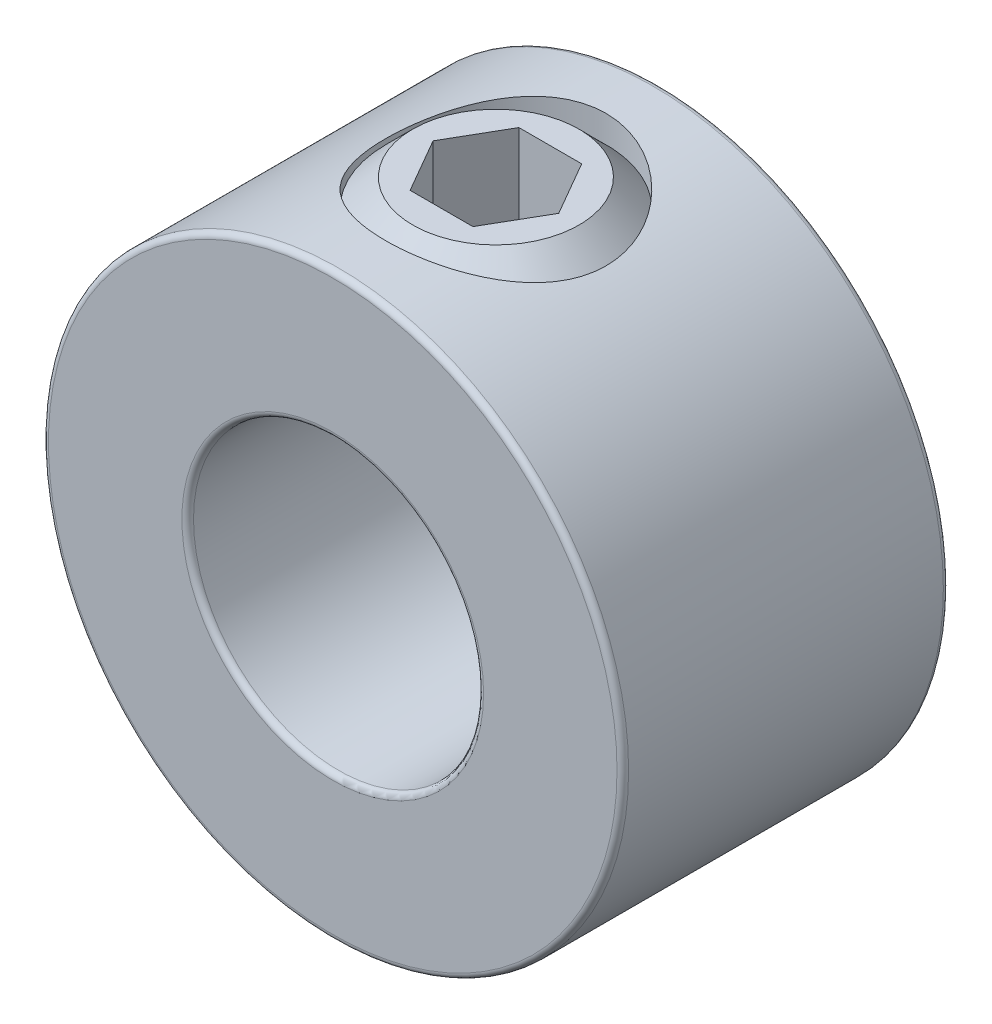
ISO-10303-21;
HEADER;
FILE_DESCRIPTION(('STEP AP214'),'2;1');
FILE_NAME('part.step','',(''),(''),'','','');
FILE_SCHEMA(('AUTOMOTIVE_DESIGN { 1 0 10303 214 1 1 1 1 }'));
ENDSEC;
DATA;
#1=APPLICATION_CONTEXT('core data for automotive mechanical design processes');
#2=APPLICATION_PROTOCOL_DEFINITION('international standard','automotive_design',2000,#1);
#3=PRODUCT_CONTEXT('',#1,'mechanical');
#4=PRODUCT('Part','Part','',(#3));
#5=PRODUCT_RELATED_PRODUCT_CATEGORY('part','',(#4));
#6=PRODUCT_DEFINITION_FORMATION('','',#4);
#7=PRODUCT_DEFINITION_CONTEXT('part definition',#1,'design');
#8=PRODUCT_DEFINITION('design','',#6,#7);
#9=PRODUCT_DEFINITION_SHAPE('','',#8);
#10=(LENGTH_UNIT() NAMED_UNIT(*) SI_UNIT(.MILLI.,.METRE.));
#11=(NAMED_UNIT(*) PLANE_ANGLE_UNIT() SI_UNIT($,.RADIAN.));
#12=(NAMED_UNIT(*) SI_UNIT($,.STERADIAN.) SOLID_ANGLE_UNIT());
#13=UNCERTAINTY_MEASURE_WITH_UNIT(LENGTH_MEASURE(1.E-05),#10,'distance_accuracy_value','');
#14=(GEOMETRIC_REPRESENTATION_CONTEXT(3) GLOBAL_UNCERTAINTY_ASSIGNED_CONTEXT((#13)) GLOBAL_UNIT_ASSIGNED_CONTEXT((#10,
#11,#12)) REPRESENTATION_CONTEXT('',''));
#15=CARTESIAN_POINT('',(0.,0.,0.));
#16=DIRECTION('',(0.,0.,1.));
#17=DIRECTION('',(1.,0.,0.));
#18=AXIS2_PLACEMENT_3D('',#15,#16,#17);
#19=CARTESIAN_POINT('',(0.,6.35,0.));
#20=DIRECTION('',(0.,1.,0.));
#21=DIRECTION('',(-1.,0.,0.));
#22=AXIS2_PLACEMENT_3D('',#19,#20,#21);
#23=PLANE('',#22);
#24=CARTESIAN_POINT('',(0.,6.35,0.));
#25=DIRECTION('',(0.,1.,0.));
#26=DIRECTION('',(-1.,0.,0.));
#27=AXIS2_PLACEMENT_3D('',#24,#25,#26);
#28=CIRCLE('',#27,1.81975161629017);
#29=CARTESIAN_POINT('',(-1.81975161629017,6.35,0.));
#30=VERTEX_POINT('',#29);
#31=EDGE_CURVE('E12',#30,#30,#28,.T.);
#32=ORIENTED_EDGE('',*,*,#31,.T.);
#33=EDGE_LOOP('',(#32));
#34=FACE_BOUND('',#33,.T.);
#35=DIRECTION('',(1.,0.,0.));
#36=VECTOR('',#35,1.);
#37=CARTESIAN_POINT('',(-0.687407664253899,6.34999999999999,-1.190625));
#38=LINE('',#37,#36);
#39=CARTESIAN_POINT('',(-0.687407664253899,6.34999999999999,-1.190625));
#40=VERTEX_POINT('',#39);
#41=CARTESIAN_POINT('',(0.687407664253899,6.35,-1.190625));
#42=VERTEX_POINT('',#41);
#43=EDGE_CURVE('E110',#40,#42,#38,.T.);
#44=ORIENTED_EDGE('',*,*,#43,.T.);
#45=DIRECTION('',(0.5,0.,0.866025403784439));
#46=VECTOR('',#45,1.);
#47=CARTESIAN_POINT('',(0.687407664253899,6.34999999999999,-1.190625));
#48=LINE('',#47,#46);
#49=CARTESIAN_POINT('',(1.3748153285078,6.34999999999999,0.));
#50=VERTEX_POINT('',#49);
#51=EDGE_CURVE('E56',#42,#50,#48,.T.);
#52=ORIENTED_EDGE('',*,*,#51,.T.);
#53=DIRECTION('',(-0.5,0.,0.866025403784439));
#54=VECTOR('',#53,1.);
#55=CARTESIAN_POINT('',(1.3748153285078,6.34999999999999,0.));
#56=LINE('',#55,#54);
#57=CARTESIAN_POINT('',(0.687407664253899,6.34999999999999,1.190625));
#58=VERTEX_POINT('',#57);
#59=EDGE_CURVE('E114',#50,#58,#56,.T.);
#60=ORIENTED_EDGE('',*,*,#59,.T.);
#61=DIRECTION('',(-1.,0.,0.));
#62=VECTOR('',#61,1.);
#63=CARTESIAN_POINT('',(0.687407664253899,6.34999999999999,1.190625));
#64=LINE('',#63,#62);
#65=CARTESIAN_POINT('',(-0.687407664253898,6.34999999999999,1.190625));
#66=VERTEX_POINT('',#65);
#67=EDGE_CURVE('E177',#58,#66,#64,.T.);
#68=ORIENTED_EDGE('',*,*,#67,.T.);
#69=DIRECTION('',(-0.5,0.,-0.866025403784439));
#70=VECTOR('',#69,1.);
#71=CARTESIAN_POINT('',(-0.687407664253898,6.34999999999999,1.190625));
#72=LINE('',#71,#70);
#73=CARTESIAN_POINT('',(-1.3748153285078,6.34999999999999,0.));
#74=VERTEX_POINT('',#73);
#75=EDGE_CURVE('E162',#66,#74,#72,.T.);
#76=ORIENTED_EDGE('',*,*,#75,.T.);
#77=DIRECTION('',(0.5,0.,-0.866025403784439));
#78=VECTOR('',#77,1.);
#79=CARTESIAN_POINT('',(-1.3748153285078,6.34999999999999,0.));
#80=LINE('',#79,#78);
#81=EDGE_CURVE('E158',#74,#40,#80,.T.);
#82=ORIENTED_EDGE('',*,*,#81,.T.);
#83=EDGE_LOOP('',(#44,#52,#60,#68,#76,#82));
#84=FACE_BOUND('',#83,.T.);
#85=ADVANCED_FACE('F42',(#34,#84),#23,.T.);
#86=CARTESIAN_POINT('',(0.,6.35,0.));
#87=DIRECTION('',(0.,-1.,0.));
#88=DIRECTION('',(1.,0.,0.));
#89=AXIS2_PLACEMENT_3D('',#86,#87,#88);
#90=CONICAL_SURFACE('',#89,1.81975161629017,0.785398163397448);
#91=CARTESIAN_POINT('',(0.,5.75675161629017,0.));
#92=DIRECTION('',(0.,1.,0.));
#93=DIRECTION('',(-1.,0.,0.));
#94=AXIS2_PLACEMENT_3D('',#91,#92,#93);
#95=CIRCLE('',#94,2.413);
#96=CARTESIAN_POINT('',(-2.413,5.75675161629017,0.));
#97=VERTEX_POINT('',#96);
#98=EDGE_CURVE('E49',#97,#97,#95,.T.);
#99=ORIENTED_EDGE('',*,*,#98,.T.);
#100=EDGE_LOOP('',(#99));
#101=FACE_BOUND('',#100,.T.);
#102=ORIENTED_EDGE('',*,*,#31,.F.);
#103=EDGE_LOOP('',(#102));
#104=FACE_BOUND('',#103,.T.);
#105=ADVANCED_FACE('F132',(#101,#104),#90,.T.);
#106=CARTESIAN_POINT('',(0.,3.175,0.));
#107=DIRECTION('',(0.,1.,0.));
#108=DIRECTION('',(-1.,0.,0.));
#109=AXIS2_PLACEMENT_3D('',#106,#107,#108);
#110=CYLINDRICAL_SURFACE('',#109,2.413);
#111=CARTESIAN_POINT('',(0.,3.76824838370983,0.));
#112=DIRECTION('',(0.,1.,0.));
#113=DIRECTION('',(-1.,0.,0.));
#114=AXIS2_PLACEMENT_3D('',#111,#112,#113);
#115=CIRCLE('',#114,2.413);
#116=CARTESIAN_POINT('',(-2.413,3.76824838370983,0.));
#117=VERTEX_POINT('',#116);
#118=EDGE_CURVE('E127',#117,#117,#115,.T.);
#119=ORIENTED_EDGE('',*,*,#118,.T.);
#120=EDGE_LOOP('',(#119));
#121=FACE_BOUND('',#120,.T.);
#122=ORIENTED_EDGE('',*,*,#98,.F.);
#123=EDGE_LOOP('',(#122));
#124=FACE_BOUND('',#123,.T.);
#125=ADVANCED_FACE('F135',(#121,#124),#110,.T.);
#126=CARTESIAN_POINT('',(0.,3.76824838370983,0.));
#127=DIRECTION('',(0.,1.,0.));
#128=DIRECTION('',(-1.,0.,0.));
#129=AXIS2_PLACEMENT_3D('',#126,#127,#128);
#130=CONICAL_SURFACE('',#129,2.413,0.785398163397448);
#131=CARTESIAN_POINT('',(0.,3.175,0.));
#132=DIRECTION('',(0.,1.,0.));
#133=DIRECTION('',(-1.,0.,0.));
#134=AXIS2_PLACEMENT_3D('',#131,#132,#133);
#135=CIRCLE('',#134,1.81975161629017);
#136=CARTESIAN_POINT('',(-1.81975161629017,3.175,0.));
#137=VERTEX_POINT('',#136);
#138=EDGE_CURVE('E119',#137,#137,#135,.T.);
#139=ORIENTED_EDGE('',*,*,#138,.T.);
#140=EDGE_LOOP('',(#139));
#141=FACE_BOUND('',#140,.T.);
#142=ORIENTED_EDGE('',*,*,#118,.F.);
#143=EDGE_LOOP('',(#142));
#144=FACE_BOUND('',#143,.T.);
#145=ADVANCED_FACE('F137',(#141,#144),#130,.T.);
#146=CARTESIAN_POINT('',(-1.81975161629017,3.175,0.));
#147=DIRECTION('',(0.,-1.,0.));
#148=DIRECTION('',(1.,0.,0.));
#149=AXIS2_PLACEMENT_3D('',#146,#147,#148);
#150=PLANE('',#149);
#151=CARTESIAN_POINT('',(0.,3.175,0.));
#152=DIRECTION('',(0.,1.,0.));
#153=DIRECTION('',(-1.,0.,0.));
#154=AXIS2_PLACEMENT_3D('',#151,#152,#153);
#155=CIRCLE('',#154,0.711898060451796);
#156=CARTESIAN_POINT('',(-0.711898060451796,3.175,0.));
#157=VERTEX_POINT('',#156);
#158=EDGE_CURVE('E115',#157,#157,#155,.T.);
#159=ORIENTED_EDGE('',*,*,#158,.T.);
#160=EDGE_LOOP('',(#159));
#161=FACE_BOUND('',#160,.T.);
#162=ORIENTED_EDGE('',*,*,#138,.F.);
#163=EDGE_LOOP('',(#162));
#164=FACE_BOUND('',#163,.T.);
#165=ADVANCED_FACE('F144',(#161,#164),#150,.T.);
#166=CARTESIAN_POINT('',(0.,3.175,0.));
#167=DIRECTION('',(0.,-1.,0.));
#168=DIRECTION('',(1.,0.,0.));
#169=AXIS2_PLACEMENT_3D('',#166,#167,#168);
#170=CONICAL_SURFACE('',#169,0.711898060451796,0.785398163397448);
#171=CARTESIAN_POINT('',(0.,3.8868980604518,0.));
#172=VERTEX_POINT('',#171);
#173=VERTEX_LOOP('',#172);
#174=FACE_BOUND('',#173,.T.);
#175=ORIENTED_EDGE('',*,*,#158,.F.);
#176=EDGE_LOOP('',(#175));
#177=FACE_BOUND('',#176,.T.);
#178=ADVANCED_FACE('F211',(#174,#177),#170,.F.);
#179=CARTESIAN_POINT('',(0.687407664253899,3.96874999999999,-1.190625));
#180=DIRECTION('',(-0.866025403784439,0.,0.5));
#181=DIRECTION('',(0.5,0.,0.866025403784439));
#182=AXIS2_PLACEMENT_3D('',#179,#180,#181);
#183=PLANE('',#182);
#184=ORIENTED_EDGE('',*,*,#51,.F.);
#185=DIRECTION('',(0.,1.,0.));
#186=VECTOR('',#185,1.);
#187=CARTESIAN_POINT('',(0.687407664253899,3.96874999999999,-1.190625));
#188=LINE('',#187,#186);
#189=CARTESIAN_POINT('',(0.687407664253899,3.96874999999999,-1.190625));
#190=VERTEX_POINT('',#189);
#191=EDGE_CURVE('E109',#190,#42,#188,.T.);
#192=ORIENTED_EDGE('',*,*,#191,.F.);
#193=DIRECTION('',(0.5,0.,0.866025403784439));
#194=VECTOR('',#193,1.);
#195=CARTESIAN_POINT('',(0.687407664253899,3.96874999999999,-1.190625));
#196=LINE('',#195,#194);
#197=CARTESIAN_POINT('',(1.3748153285078,3.96874999999999,0.));
#198=VERTEX_POINT('',#197);
#199=EDGE_CURVE('E100',#190,#198,#196,.T.);
#200=ORIENTED_EDGE('',*,*,#199,.T.);
#201=DIRECTION('',(0.,1.,0.));
#202=VECTOR('',#201,1.);
#203=CARTESIAN_POINT('',(1.3748153285078,3.96874999999999,0.));
#204=LINE('',#203,#202);
#205=EDGE_CURVE('E108',#198,#50,#204,.T.);
#206=ORIENTED_EDGE('',*,*,#205,.T.);
#207=EDGE_LOOP('',(#184,#192,#200,#206));
#208=FACE_BOUND('',#207,.T.);
#209=ADVANCED_FACE('F107',(#208),#183,.T.);
#210=CARTESIAN_POINT('',(1.3748153285078,3.96874999999999,0.));
#211=DIRECTION('',(-0.866025403784439,0.,-0.5));
#212=DIRECTION('',(-0.5,0.,0.866025403784439));
#213=AXIS2_PLACEMENT_3D('',#210,#211,#212);
#214=PLANE('',#213);
#215=ORIENTED_EDGE('',*,*,#59,.F.);
#216=ORIENTED_EDGE('',*,*,#205,.F.);
#217=DIRECTION('',(-0.5,0.,0.866025403784439));
#218=VECTOR('',#217,1.);
#219=CARTESIAN_POINT('',(1.3748153285078,3.96874999999999,0.));
#220=LINE('',#219,#218);
#221=CARTESIAN_POINT('',(0.687407664253899,3.96874999999999,1.190625));
#222=VERTEX_POINT('',#221);
#223=EDGE_CURVE('E96',#198,#222,#220,.T.);
#224=ORIENTED_EDGE('',*,*,#223,.T.);
#225=DIRECTION('',(0.,1.,0.));
#226=VECTOR('',#225,1.);
#227=CARTESIAN_POINT('',(0.687407664253899,3.96874999999999,1.190625));
#228=LINE('',#227,#226);
#229=EDGE_CURVE('E116',#222,#58,#228,.T.);
#230=ORIENTED_EDGE('',*,*,#229,.T.);
#231=EDGE_LOOP('',(#215,#216,#224,#230));
#232=FACE_BOUND('',#231,.T.);
#233=ADVANCED_FACE('F112',(#232),#214,.T.);
#234=CARTESIAN_POINT('',(0.687407664253899,3.96874999999999,1.190625));
#235=DIRECTION('',(0.,0.,-1.));
#236=DIRECTION('',(-1.,0.,0.));
#237=AXIS2_PLACEMENT_3D('',#234,#235,#236);
#238=PLANE('',#237);
#239=ORIENTED_EDGE('',*,*,#67,.F.);
#240=ORIENTED_EDGE('',*,*,#229,.F.);
#241=DIRECTION('',(-1.,0.,0.));
#242=VECTOR('',#241,1.);
#243=CARTESIAN_POINT('',(0.687407664253899,3.96874999999999,1.190625));
#244=LINE('',#243,#242);
#245=CARTESIAN_POINT('',(-0.687407664253898,3.96874999999999,1.190625));
#246=VERTEX_POINT('',#245);
#247=EDGE_CURVE('E102',#222,#246,#244,.T.);
#248=ORIENTED_EDGE('',*,*,#247,.T.);
#249=DIRECTION('',(0.,1.,0.));
#250=VECTOR('',#249,1.);
#251=CARTESIAN_POINT('',(-0.687407664253898,3.96874999999999,1.190625));
#252=LINE('',#251,#250);
#253=EDGE_CURVE('E121',#246,#66,#252,.T.);
#254=ORIENTED_EDGE('',*,*,#253,.T.);
#255=EDGE_LOOP('',(#239,#240,#248,#254));
#256=FACE_BOUND('',#255,.T.);
#257=ADVANCED_FACE('F175',(#256),#238,.T.);
#258=CARTESIAN_POINT('',(-0.687407664253898,3.96874999999999,1.190625));
#259=DIRECTION('',(0.866025403784439,0.,-0.5));
#260=DIRECTION('',(-0.5,0.,-0.866025403784438));
#261=AXIS2_PLACEMENT_3D('',#258,#259,#260);
#262=PLANE('',#261);
#263=ORIENTED_EDGE('',*,*,#75,.F.);
#264=ORIENTED_EDGE('',*,*,#253,.F.);
#265=DIRECTION('',(-0.5,0.,-0.866025403784439));
#266=VECTOR('',#265,1.);
#267=CARTESIAN_POINT('',(-0.687407664253898,3.96874999999999,1.190625));
#268=LINE('',#267,#266);
#269=CARTESIAN_POINT('',(-1.3748153285078,3.96874999999999,0.));
#270=VERTEX_POINT('',#269);
#271=EDGE_CURVE('E188',#246,#270,#268,.T.);
#272=ORIENTED_EDGE('',*,*,#271,.T.);
#273=DIRECTION('',(0.,1.,0.));
#274=VECTOR('',#273,1.);
#275=CARTESIAN_POINT('',(-1.3748153285078,3.96874999999999,0.));
#276=LINE('',#275,#274);
#277=EDGE_CURVE('E170',#270,#74,#276,.T.);
#278=ORIENTED_EDGE('',*,*,#277,.T.);
#279=EDGE_LOOP('',(#263,#264,#272,#278));
#280=FACE_BOUND('',#279,.T.);
#281=ADVANCED_FACE('F179',(#280),#262,.T.);
#282=CARTESIAN_POINT('',(-1.3748153285078,3.96874999999999,0.));
#283=DIRECTION('',(0.866025403784439,0.,0.5));
#284=DIRECTION('',(0.5,0.,-0.866025403784439));
#285=AXIS2_PLACEMENT_3D('',#282,#283,#284);
#286=PLANE('',#285);
#287=ORIENTED_EDGE('',*,*,#81,.F.);
#288=ORIENTED_EDGE('',*,*,#277,.F.);
#289=DIRECTION('',(0.5,0.,-0.866025403784439));
#290=VECTOR('',#289,1.);
#291=CARTESIAN_POINT('',(-1.3748153285078,3.96874999999999,0.));
#292=LINE('',#291,#290);
#293=CARTESIAN_POINT('',(-0.687407664253899,3.96874999999999,-1.190625));
#294=VERTEX_POINT('',#293);
#295=EDGE_CURVE('E186',#270,#294,#292,.T.);
#296=ORIENTED_EDGE('',*,*,#295,.T.);
#297=DIRECTION('',(0.,1.,0.));
#298=VECTOR('',#297,1.);
#299=CARTESIAN_POINT('',(-0.687407664253899,3.96874999999999,-1.190625));
#300=LINE('',#299,#298);
#301=EDGE_CURVE('E167',#294,#40,#300,.T.);
#302=ORIENTED_EDGE('',*,*,#301,.T.);
#303=EDGE_LOOP('',(#287,#288,#296,#302));
#304=FACE_BOUND('',#303,.T.);
#305=ADVANCED_FACE('F192',(#304),#286,.T.);
#306=CARTESIAN_POINT('',(-0.687407664253899,3.96874999999999,-1.190625));
#307=DIRECTION('',(0.,0.,1.));
#308=DIRECTION('',(1.,0.,0.));
#309=AXIS2_PLACEMENT_3D('',#306,#307,#308);
#310=PLANE('',#309);
#311=ORIENTED_EDGE('',*,*,#43,.F.);
#312=ORIENTED_EDGE('',*,*,#301,.F.);
#313=DIRECTION('',(1.,0.,0.));
#314=VECTOR('',#313,1.);
#315=CARTESIAN_POINT('',(-0.687407664253899,3.96874999999999,-1.190625));
#316=LINE('',#315,#314);
#317=EDGE_CURVE('E168',#294,#190,#316,.T.);
#318=ORIENTED_EDGE('',*,*,#317,.T.);
#319=ORIENTED_EDGE('',*,*,#191,.T.);
#320=EDGE_LOOP('',(#311,#312,#318,#319));
#321=FACE_BOUND('',#320,.T.);
#322=ADVANCED_FACE('F193',(#321),#310,.T.);
#323=CARTESIAN_POINT('',(2.06222299276169,3.96874999999999,1.190625));
#324=DIRECTION('',(0.,-1.,0.));
#325=DIRECTION('',(0.,0.,-1.));
#326=AXIS2_PLACEMENT_3D('',#323,#324,#325);
#327=PLANE('',#326);
#328=ORIENTED_EDGE('',*,*,#199,.F.);
#329=ORIENTED_EDGE('',*,*,#317,.F.);
#330=ORIENTED_EDGE('',*,*,#295,.F.);
#331=ORIENTED_EDGE('',*,*,#271,.F.);
#332=ORIENTED_EDGE('',*,*,#247,.F.);
#333=ORIENTED_EDGE('',*,*,#223,.F.);
#334=EDGE_LOOP('',(#328,#329,#330,#331,#332,#333));
#335=FACE_BOUND('',#334,.T.);
#336=ADVANCED_FACE('F98',(#335),#327,.F.);
#337=CLOSED_SHELL('',(#85,#105,#125,#145,#165,#178,#209,#233,#257,#281,#305,#322,#336));
#338=MANIFOLD_SOLID_BREP('B2',#337);
#339=CARTESIAN_POINT('',(0.,0.,3.571875));
#340=DIRECTION('',(0.,0.,1.));
#341=DIRECTION('',(1.,0.,0.));
#342=AXIS2_PLACEMENT_3D('',#339,#340,#341);
#343=PLANE('',#342);
#344=CARTESIAN_POINT('',(0.,0.,3.571875));
#345=DIRECTION('',(0.,0.,1.));
#346=DIRECTION('',(1.,0.,0.));
#347=AXIS2_PLACEMENT_3D('',#344,#345,#346);
#348=CIRCLE('',#347,3.302);
#349=CARTESIAN_POINT('',(3.302,0.,3.571875));
#350=VERTEX_POINT('',#349);
#351=EDGE_CURVE('E307',#350,#350,#348,.F.);
#352=ORIENTED_EDGE('',*,*,#351,.T.);
#353=EDGE_LOOP('',(#352));
#354=FACE_BOUND('',#353,.T.);
#355=CARTESIAN_POINT('',(0.,0.,3.571875));
#356=DIRECTION('',(0.,0.,1.));
#357=DIRECTION('',(1.,0.,0.));
#358=AXIS2_PLACEMENT_3D('',#355,#356,#357);
#359=CIRCLE('',#358,6.223);
#360=CARTESIAN_POINT('',(6.223,0.,3.571875));
#361=VERTEX_POINT('',#360);
#362=EDGE_CURVE('E311',#361,#361,#359,.T.);
#363=ORIENTED_EDGE('',*,*,#362,.T.);
#364=EDGE_LOOP('',(#363));
#365=FACE_BOUND('',#364,.T.);
#366=ADVANCED_FACE('F296',(#354,#365),#343,.T.);
#367=CARTESIAN_POINT('',(0.,0.,-3.571875));
#368=DIRECTION('',(0.,0.,1.));
#369=DIRECTION('',(1.,0.,0.));
#370=AXIS2_PLACEMENT_3D('',#367,#368,#369);
#371=PLANE('',#370);
#372=CARTESIAN_POINT('',(0.,0.,-3.571875));
#373=DIRECTION('',(0.,0.,1.));
#374=DIRECTION('',(1.,0.,0.));
#375=AXIS2_PLACEMENT_3D('',#372,#373,#374);
#376=CIRCLE('',#375,3.302);
#377=CARTESIAN_POINT('',(3.302,0.,-3.571875));
#378=VERTEX_POINT('',#377);
#379=EDGE_CURVE('E322',#378,#378,#376,.T.);
#380=ORIENTED_EDGE('',*,*,#379,.T.);
#381=EDGE_LOOP('',(#380));
#382=FACE_BOUND('',#381,.T.);
#383=CARTESIAN_POINT('',(0.,0.,-3.571875));
#384=DIRECTION('',(0.,0.,1.));
#385=DIRECTION('',(1.,0.,0.));
#386=AXIS2_PLACEMENT_3D('',#383,#384,#385);
#387=CIRCLE('',#386,6.223);
#388=CARTESIAN_POINT('',(6.223,0.,-3.571875));
#389=VERTEX_POINT('',#388);
#390=EDGE_CURVE('E325',#389,#389,#387,.F.);
#391=ORIENTED_EDGE('',*,*,#390,.T.);
#392=EDGE_LOOP('',(#391));
#393=FACE_BOUND('',#392,.T.);
#394=ADVANCED_FACE('F361',(#382,#393),#371,.F.);
#395=CARTESIAN_POINT('',(0.,0.,3.571875));
#396=DIRECTION('',(0.,0.,-1.));
#397=DIRECTION('',(-1.,0.,0.));
#398=AXIS2_PLACEMENT_3D('',#395,#396,#397);
#399=CYLINDRICAL_SURFACE('',#398,6.35);
#400=CARTESIAN_POINT('',(0.,0.,-3.444875));
#401=DIRECTION('',(0.,0.,1.));
#402=DIRECTION('',(1.,0.,0.));
#403=AXIS2_PLACEMENT_3D('',#400,#401,#402);
#404=CIRCLE('',#403,6.35);
#405=CARTESIAN_POINT('',(6.35,0.,-3.444875));
#406=VERTEX_POINT('',#405);
#407=EDGE_CURVE('E41',#406,#406,#404,.T.);
#408=ORIENTED_EDGE('',*,*,#407,.T.);
#409=EDGE_LOOP('',(#408));
#410=FACE_BOUND('',#409,.T.);
#411=CARTESIAN_POINT('',(0.,0.,3.444875));
#412=DIRECTION('',(0.,0.,1.));
#413=DIRECTION('',(1.,0.,0.));
#414=AXIS2_PLACEMENT_3D('',#411,#412,#413);
#415=CIRCLE('',#414,6.35);
#416=CARTESIAN_POINT('',(6.35,0.,3.444875));
#417=VERTEX_POINT('',#416);
#418=EDGE_CURVE('E303',#417,#417,#415,.F.);
#419=ORIENTED_EDGE('',*,*,#418,.T.);
#420=EDGE_LOOP('',(#419));
#421=FACE_BOUND('',#420,.T.);
#422=CARTESIAN_POINT('',(0.,6.35,-2.413));
#423=CARTESIAN_POINT('',(0.130555931467962,6.35000398969011,-2.41300527534602));
#424=CARTESIAN_POINT('',(0.261076241377739,6.34593890816647,-2.4023714543113));
#425=CARTESIAN_POINT('',(0.518209446534913,6.33012963929965,-2.36029479676423));
#426=CARTESIAN_POINT('',(0.644823015088655,6.31838678300935,-2.32885556715778));
#427=CARTESIAN_POINT('',(0.890396734122701,6.28848040494,-2.24644511602075));
#428=CARTESIAN_POINT('',(1.00937135935963,6.27032947705095,-2.19551218938446));
#429=CARTESIAN_POINT('',(1.23707694907279,6.22940932060409,-2.07575764561934));
#430=CARTESIAN_POINT('',(1.34580507871092,6.20663881943741,-2.00693109764769));
#431=CARTESIAN_POINT('',(1.5546544090621,6.15771932779737,-1.85022277092613));
#432=CARTESIAN_POINT('',(1.65427192875035,6.13147296383124,-1.76170041624995));
#433=CARTESIAN_POINT('',(1.83765571561736,6.07903240405007,-1.56947315042905));
#434=CARTESIAN_POINT('',(1.92141693988139,6.05283822744466,-1.46576342765122));
#435=CARTESIAN_POINT('',(2.07395660623911,6.00232668170519,-1.24113386470124));
#436=CARTESIAN_POINT('',(2.14201618015845,5.97812365120729,-1.11969756154783));
#437=CARTESIAN_POINT('',(2.25652093858858,5.93585432476053,-0.866038380432351));
#438=CARTESIAN_POINT('',(2.30297502037546,5.91778550353544,-0.733819969020803));
#439=CARTESIAN_POINT('',(2.37094947712185,5.89087364983883,-0.46815363189803));
#440=CARTESIAN_POINT('',(2.39343294050412,5.88167580744491,-0.334989300795486));
#441=CARTESIAN_POINT('',(2.41583880524757,5.87251090464605,-0.0664845962936197));
#442=CARTESIAN_POINT('',(2.41577084821779,5.87253989940926,0.0688548224232351));
#443=CARTESIAN_POINT('',(2.39381090108878,5.88152011871453,0.328972227003014));
#444=CARTESIAN_POINT('',(2.37326609797153,5.88992057372023,0.453886522563246));
#445=CARTESIAN_POINT('',(2.31316652422954,5.91378008823147,0.698339704990829));
#446=CARTESIAN_POINT('',(2.27360881167116,5.92924024008996,0.817877756841903));
#447=CARTESIAN_POINT('',(2.17588364092748,5.96580146890692,1.0508916152852));
#448=CARTESIAN_POINT('',(2.11737290423754,5.98700531598431,1.16420661484106));
#449=CARTESIAN_POINT('',(1.98364217411328,6.03263175509447,1.37979639920587));
#450=CARTESIAN_POINT('',(1.90841630395244,6.05705547794376,1.4820672822727));
#451=CARTESIAN_POINT('',(1.73726689770536,6.10842961274997,1.68010694238863));
#452=CARTESIAN_POINT('',(1.64027173491613,6.13543795015635,1.77493688260015));
#453=CARTESIAN_POINT('',(1.43144868882472,6.18748920351012,1.94726806056401));
#454=CARTESIAN_POINT('',(1.31961840653187,6.2125318005324,2.02476649017818));
#455=CARTESIAN_POINT('',(1.08185265975391,6.25835188225341,2.16130771487283));
#456=CARTESIAN_POINT('',(0.955717417234618,6.27905339803369,2.22002994310971));
#457=CARTESIAN_POINT('',(0.694375189035109,6.31329326294077,2.31510736575226));
#458=CARTESIAN_POINT('',(0.559172376611221,6.32683488218724,2.3514727723643));
#459=CARTESIAN_POINT('',(0.291428150212525,6.3446501972992,2.39898109857718));
#460=CARTESIAN_POINT('',(0.159141645079808,6.34938771868047,2.41138775288999));
#461=CARTESIAN_POINT('',(-0.105693065348276,6.35049981057155,2.41431626348443));
#462=CARTESIAN_POINT('',(-0.238241203822052,6.34687629478166,2.40484312768025));
#463=CARTESIAN_POINT('',(-0.494323602805378,6.33197908606406,2.36523562382545));
#464=CARTESIAN_POINT('',(-0.61800684441211,6.32101461634214,2.33593589818825));
#465=CARTESIAN_POINT('',(-0.858609565436108,6.29285092848222,2.25861304376362));
#466=CARTESIAN_POINT('',(-0.975528163914414,6.27565090041604,2.21058748264173));
#467=CARTESIAN_POINT('',(-1.20317276582384,6.23607457125026,2.09563503714011));
#468=CARTESIAN_POINT('',(-1.3136121499673,6.21355984396609,2.02818967610491));
#469=CARTESIAN_POINT('',(-1.52197988578177,6.16583504517286,1.87689595883598));
#470=CARTESIAN_POINT('',(-1.61990351002366,6.14062396176678,1.79304143465584));
#471=CARTESIAN_POINT('',(-1.80656807112922,6.08841217199752,1.60543272496061));
#472=CARTESIAN_POINT('',(-1.89441393314817,6.06139435477813,1.5007904098217));
#473=CARTESIAN_POINT('',(-2.05148411432654,6.01005496187559,1.27772800811267));
#474=CARTESIAN_POINT('',(-2.12070651399853,5.98573366426972,1.15930650314625));
#475=CARTESIAN_POINT('',(-2.23870023772464,5.94261798623815,0.910922748538602));
#476=CARTESIAN_POINT('',(-2.28736466342468,5.92385264334907,0.780904332023381));
#477=CARTESIAN_POINT('',(-2.36177800946808,5.89458517077402,0.513602694331982));
#478=CARTESIAN_POINT('',(-2.38754162954713,5.8840777409413,0.376324193363579));
#479=CARTESIAN_POINT('',(-2.41408994040532,5.87323215610138,0.108127165215383));
#480=CARTESIAN_POINT('',(-2.41640623148607,5.87227054588007,-0.0226157343841075));
#481=CARTESIAN_POINT('',(-2.3999373204655,5.8790202253426,-0.282524873396556));
#482=CARTESIAN_POINT('',(-2.38115423316032,5.88673064582666,-0.41169126951125));
#483=CARTESIAN_POINT('',(-2.32422421188573,5.90943043237583,-0.660552265849344));
#484=CARTESIAN_POINT('',(-2.28672002796391,5.92417751295514,-0.780417919491674));
#485=CARTESIAN_POINT('',(-2.19398528189399,5.95914188552999,-1.01222145618602));
#486=CARTESIAN_POINT('',(-2.13875018285588,5.97936057736356,-1.12415730124382));
#487=CARTESIAN_POINT('',(-2.00869997639504,6.02433337271119,-1.34342800575803));
#488=CARTESIAN_POINT('',(-1.93299650808671,6.04927206356278,-1.4501976241717));
#489=CARTESIAN_POINT('',(-1.76551836882645,6.10025417003155,-1.65000619367226));
#490=CARTESIAN_POINT('',(-1.67373852090438,6.12629793945648,-1.74304070389426));
#491=CARTESIAN_POINT('',(-1.47055494697206,6.17831294001547,-1.91807209951937));
#492=CARTESIAN_POINT('',(-1.35833856072122,6.20419794006484,-1.99915556641372));
#493=CARTESIAN_POINT('',(-1.12096041375387,6.25144642675378,-2.14129762074769));
#494=CARTESIAN_POINT('',(-0.995797050693124,6.27280935273315,-2.20235372565052));
#495=CARTESIAN_POINT('',(-0.728778395788011,6.30955475572144,-2.30499263616226));
#496=CARTESIAN_POINT('',(-0.58638469778337,6.32454657619379,-2.3453288052365));
#497=CARTESIAN_POINT('',(-0.295976705251577,6.34476431329028,-2.39932232882264));
#498=CARTESIAN_POINT('',(-0.147965475024477,6.34999547828747,-2.41299402119021));
#499=CARTESIAN_POINT('',(0.,6.35,-2.413));
#500=B_SPLINE_CURVE_WITH_KNOTS('',3,(#422,#423,#424,#425,#426,#427,#428,#429,#430,#431,#432,
#433,#434,#435,#436,#437,#438,#439,#440,#441,#442,#443,#444,#445,#446,#447,#448,#449,#450,#451,
#452,#453,#454,#455,#456,#457,#458,#459,#460,#461,#462,#463,#464,#465,#466,#467,#468,#469,#470,
#471,#472,#473,#474,#475,#476,#477,#478,#479,#480,#481,#482,#483,#484,#485,#486,#487,#488,#489,
#490,#491,#492,#493,#494,#495,#496,#497,#498,#499),.UNSPECIFIED.,.T.,.F.,(4,2,2,2,2,2,2,2,2,2,2,
2,2,2,2,2,2,2,2,2,2,2,2,2,2,2,2,2,2,2,2,2,2,2,2,2,2,2,4),(0.,0.391121887064184,
0.782175985486185,1.17246577830223,1.56286323524963,1.96854634212709,2.37435825594016,
2.79613130529395,3.21773051175688,3.62166628723491,4.02542936468621,4.40427313209371,
4.78317553819666,5.16936515238192,5.55569075901495,5.96873424705112,6.38184461005431,
6.80167192308661,7.22130732355892,7.61812936188612,8.01486058335588,8.39585156202364,
8.77689204483065,9.16923685274999,9.56172942118012,9.9776135359701,10.3935404987953,
10.8116043631128,11.2293996833676,11.6197130905881,12.0099873800853,12.3876994067832,
12.7655081575183,13.1635000328781,13.5616203073395,13.9821012344605,14.4026342635628,
14.8461505355472,15.2894282569131),.UNSPECIFIED.);
#501=CARTESIAN_POINT('',(0.,6.35,-2.413));
#502=VERTEX_POINT('',#501);
#503=EDGE_CURVE('E328',#502,#502,#500,.T.);
#504=ORIENTED_EDGE('',*,*,#503,.T.);
#505=EDGE_LOOP('',(#504));
#506=FACE_BOUND('',#505,.T.);
#507=ADVANCED_FACE('F357',(#410,#421,#506),#399,.T.);
#508=CARTESIAN_POINT('',(0.,0.,3.571875));
#509=DIRECTION('',(0.,0.,-1.));
#510=DIRECTION('',(-1.,0.,0.));
#511=AXIS2_PLACEMENT_3D('',#508,#509,#510);
#512=CYLINDRICAL_SURFACE('',#511,3.175);
#513=CARTESIAN_POINT('',(0.,0.,-3.444875));
#514=DIRECTION('',(0.,0.,1.));
#515=DIRECTION('',(1.,0.,0.));
#516=AXIS2_PLACEMENT_3D('',#513,#514,#515);
#517=CIRCLE('',#516,3.175);
#518=CARTESIAN_POINT('',(3.175,0.,-3.444875));
#519=VERTEX_POINT('',#518);
#520=EDGE_CURVE('E316',#519,#519,#517,.F.);
#521=ORIENTED_EDGE('',*,*,#520,.T.);
#522=EDGE_LOOP('',(#521));
#523=FACE_BOUND('',#522,.T.);
#524=CARTESIAN_POINT('',(0.,0.,3.444875));
#525=DIRECTION('',(0.,0.,1.));
#526=DIRECTION('',(1.,0.,0.));
#527=AXIS2_PLACEMENT_3D('',#524,#525,#526);
#528=CIRCLE('',#527,3.175);
#529=CARTESIAN_POINT('',(3.175,0.,3.444875));
#530=VERTEX_POINT('',#529);
#531=EDGE_CURVE('E319',#530,#530,#528,.T.);
#532=ORIENTED_EDGE('',*,*,#531,.T.);
#533=EDGE_LOOP('',(#532));
#534=FACE_BOUND('',#533,.T.);
#535=CARTESIAN_POINT('',(0.,3.175,-2.413));
#536=CARTESIAN_POINT('',(0.117443171605231,3.17499092904906,-2.41299058031907));
#537=CARTESIAN_POINT('',(0.23503818841931,3.16841692674332,-2.4043581847269));
#538=CARTESIAN_POINT('',(0.466484967913331,3.14271336140829,-2.37038175457781));
#539=CARTESIAN_POINT('',(0.580328596183407,3.12355818632314,-2.34500362950094));
#540=CARTESIAN_POINT('',(0.80033693546367,3.07452724978738,-2.27928432631256));
#541=CARTESIAN_POINT('',(0.906543039514099,3.04471549355359,-2.23903243487973));
#542=CARTESIAN_POINT('',(1.10997011785933,2.97659455342082,-2.14548015839209));
#543=CARTESIAN_POINT('',(1.20719255384311,2.93828675533249,-2.09218190121579));
#544=CARTESIAN_POINT('',(1.40022726688529,2.85170030734834,-1.96882085307546));
#545=CARTESIAN_POINT('',(1.49506365463583,2.80282512985173,-1.89765858122501));
#546=CARTESIAN_POINT('',(1.67223382567996,2.7008760546092,-1.7435641158176));
#547=CARTESIAN_POINT('',(1.75454859398162,2.64779595363648,-1.66061438438314));
#548=CARTESIAN_POINT('',(1.92203888294129,2.5296135351956,-1.46565859240837));
#549=CARTESIAN_POINT('',(2.00423140536036,2.4643124367144,-1.35120048467098));
#550=CARTESIAN_POINT('',(2.14857118710811,2.33951215894306,-1.10735736644856));
#551=CARTESIAN_POINT('',(2.21074385995913,2.28000569136514,-0.977991565717825));
#552=CARTESIAN_POINT('',(2.29462037317499,2.19490180220151,-0.752497308608559));
#553=CARTESIAN_POINT('',(2.32287346332998,2.16472241167552,-0.66055827907226));
#554=CARTESIAN_POINT('',(2.36849823013454,2.11470881226284,-0.47139038700259));
#555=CARTESIAN_POINT('',(2.38589523743028,2.09485053921884,-0.374174418255039));
#556=CARTESIAN_POINT('',(2.40870358471578,2.06860028206587,-0.175460476777278));
#557=CARTESIAN_POINT('',(2.4139959431512,2.06234200752845,-0.073929905731699));
#558=CARTESIAN_POINT('',(2.41169213967819,2.06503422028968,0.128798184800726));
#559=CARTESIAN_POINT('',(2.40409306334661,2.07398814667793,0.22999562379254));
#560=CARTESIAN_POINT('',(2.37836508518799,2.10340433920656,0.416917246134645));
#561=CARTESIAN_POINT('',(2.36156171265492,2.1224091464969,0.503073429560243));
#562=CARTESIAN_POINT('',(2.31942910669347,2.16837457604816,0.671064962974234));
#563=CARTESIAN_POINT('',(2.29409116468348,2.19534332114491,0.752895800354834));
#564=CARTESIAN_POINT('',(2.21702947004233,2.27376916611904,0.962631680289748));
#565=CARTESIAN_POINT('',(2.15880606368402,2.32983777456744,1.08642083974007));
#566=CARTESIAN_POINT('',(2.0240584670168,2.44783368287627,1.32063556736185));
#567=CARTESIAN_POINT('',(1.94748865288627,2.50977535205404,1.43102676980356));
#568=CARTESIAN_POINT('',(1.77457755480707,2.63500191833982,1.64086400526623));
#569=CARTESIAN_POINT('',(1.67772908569284,2.69827393808612,1.73990181478264));
#570=CARTESIAN_POINT('',(1.46641465679805,2.81868720555883,1.92133244794249));
#571=CARTESIAN_POINT('',(1.35198192561174,2.87583967861316,2.00375600179513));
#572=CARTESIAN_POINT('',(1.1302184691796,2.96897239724258,2.13504920976438));
#573=CARTESIAN_POINT('',(1.02573469648465,3.00691100546587,2.18732233798596));
#574=CARTESIAN_POINT('',(0.807524498934965,3.07269924184988,2.27691743542351));
#575=CARTESIAN_POINT('',(0.693803632023793,3.10055488265641,2.31424831636675));
#576=CARTESIAN_POINT('',(0.458986561176873,3.14392869528766,2.37204565582169));
#577=CARTESIAN_POINT('',(0.337846653718269,3.15936426972399,2.39239924216467));
#578=CARTESIAN_POINT('',(0.0929212408274502,3.17600778354888,2.41433718167044));
#579=CARTESIAN_POINT('',(-0.0308628412677098,3.17722319336241,2.41593138989231));
#580=CARTESIAN_POINT('',(-0.263113673769308,3.16598164725166,2.40112430213952));
#581=CARTESIAN_POINT('',(-0.371784896474092,3.15499411480433,2.38665711938384));
#582=CARTESIAN_POINT('',(-0.584657379974265,3.12256258934286,2.34361709819449));
#583=CARTESIAN_POINT('',(-0.688857782558675,3.10111659842469,2.31504156459624));
#584=CARTESIAN_POINT('',(-0.893151752270642,3.04866013703249,2.24429284461138));
#585=CARTESIAN_POINT('',(-0.993066473951875,3.01741404656932,2.20178337061745));
#586=CARTESIAN_POINT('',(-1.18427030490273,2.94762615076737,2.10512741976429));
#587=CARTESIAN_POINT('',(-1.27555811070553,2.90908324556455,2.05097918840424));
#588=CARTESIAN_POINT('',(-1.4629408219305,2.82008518778891,1.92283493337221));
#589=CARTESIAN_POINT('',(-1.55736336530955,2.76871323654288,1.84703979297132));
#590=CARTESIAN_POINT('',(-1.7330266340156,2.66229345480278,1.68334400808498));
#591=CARTESIAN_POINT('',(-1.81424018707203,2.60723836781931,1.59541908083344));
#592=CARTESIAN_POINT('',(-1.93310120506622,2.51929011373857,1.44596227809647));
#593=CARTESIAN_POINT('',(-1.97518148865632,2.48634042838264,1.38794003709871));
#594=CARTESIAN_POINT('',(-2.05424288960517,2.42143291492003,1.26799956797446));
#595=CARTESIAN_POINT('',(-2.09122218168265,2.38947544500995,1.2060799567393));
#596=CARTESIAN_POINT('',(-2.19405069763864,2.29677780916441,1.01470921513655));
#597=CARTESIAN_POINT('',(-2.25209423008379,2.2389759481709,0.879267670433414));
#598=CARTESIAN_POINT('',(-2.32600727289693,2.16148731453314,0.648667618119571));
#599=CARTESIAN_POINT('',(-2.34951337659766,2.13568591161393,0.557995127674168));
#600=CARTESIAN_POINT('',(-2.38597736286025,2.09487284834006,0.372275602812797));
#601=CARTESIAN_POINT('',(-2.39896041795918,2.0798354491901,0.277239585981548));
#602=CARTESIAN_POINT('',(-2.41347202601588,2.06298898322372,0.0843820043038626));
#603=CARTESIAN_POINT('',(-2.41491881071071,2.06127434940024,-0.0134545208329241));
#604=CARTESIAN_POINT('',(-2.40600289841214,2.07166816759277,-0.20788213648133));
#605=CARTESIAN_POINT('',(-2.39562846174622,2.08379036100337,-0.304471892411458));
#606=CARTESIAN_POINT('',(-2.36137219311358,2.12256830664758,-0.508834367656112));
#607=CARTESIAN_POINT('',(-2.33557340769404,2.15126142901359,-0.615881798172457));
#608=CARTESIAN_POINT('',(-2.27108364148613,2.21923176610734,-0.822515613730422));
#609=CARTESIAN_POINT('',(-2.2323592210675,2.25853638265596,-0.922081817130457));
#610=CARTESIAN_POINT('',(-2.12610942507655,2.35955877527054,-1.15053309693759));
#611=CARTESIAN_POINT('',(-2.05324191025264,2.42403799567888,-1.27569998264042));
#612=CARTESIAN_POINT('',(-1.88728411653423,2.55539518076956,-1.5104318596925));
#613=CARTESIAN_POINT('',(-1.79417076882036,2.62227580852244,-1.61997881541957));
#614=CARTESIAN_POINT('',(-1.58693666845894,2.75272337581287,-1.82362287315767));
#615=CARTESIAN_POINT('',(-1.47252844795802,2.81622750409905,-1.9174704362987));
#616=CARTESIAN_POINT('',(-1.22472214874906,2.93245405690648,-2.0844185884594));
#617=CARTESIAN_POINT('',(-1.09136873492959,2.9852011492147,-2.15756679766189));
#618=CARTESIAN_POINT('',(-0.848324156263042,3.06143310070406,-2.2616762509508));
#619=CARTESIAN_POINT('',(-0.742491250018576,3.08897584082985,-2.29871569194653));
#620=CARTESIAN_POINT('',(-0.524711420429954,3.13329848559572,-2.35794338327758));
#621=CARTESIAN_POINT('',(-0.412780537897338,3.1501052759874,-2.38016873825137));
#622=CARTESIAN_POINT('',(-0.249887399880881,3.16554486424948,-2.40054788675386));
#623=CARTESIAN_POINT('',(-0.200104041382905,3.16908209053624,-2.40520884201812));
#624=CARTESIAN_POINT('',(-0.10022305414221,3.17381185752955,-2.41143725628489));
#625=CARTESIAN_POINT('',(-0.0501253573366512,3.17500387152911,-2.41300402036888));
#626=CARTESIAN_POINT('',(0.,3.175,-2.413));
#627=B_SPLINE_CURVE_WITH_KNOTS('',3,(#535,#536,#537,#538,#539,#540,#541,#542,#543,#544,#545,
#546,#547,#548,#549,#550,#551,#552,#553,#554,#555,#556,#557,#558,#559,#560,#561,#562,#563,#564,
#565,#566,#567,#568,#569,#570,#571,#572,#573,#574,#575,#576,#577,#578,#579,#580,#581,#582,#583,
#584,#585,#586,#587,#588,#589,#590,#591,#592,#593,#594,#595,#596,#597,#598,#599,#600,#601,#602,
#603,#604,#605,#606,#607,#608,#609,#610,#611,#612,#613,#614,#615,#616,#617,#618,#619,#620,#621,
#622,#623,#624,#625,#626),.UNSPECIFIED.,.T.,.F.,(4,2,2,2,2,2,2,2,2,2,2,2,2,2,2,2,2,2,2,2,2,2,2,
2,2,2,2,2,2,2,2,2,2,2,2,2,2,2,2,2,2,2,2,2,2,4),(0.,0.352113770291782,0.704946585369681,
1.05569488379078,1.40638601280107,1.78976092813112,2.17371233600607,2.63773050853704,
3.10115730525324,3.40258553658297,3.70330778533679,4.00697348207613,4.31070783899934,
4.57916413533347,4.84789519559245,5.28900480236595,5.73122295780719,6.18621377116464,
6.64035513804427,7.00739894320242,7.37422351187941,7.74346787257931,8.11251824563582,
8.44151894934109,8.77058252746343,9.10825790412116,9.44598421987268,9.83917081589853,
10.2331562784928,10.469557715449,10.7060435254032,11.1774135342105,11.4679029980311,
11.757695504225,12.0495402292483,12.3416750384965,12.6811651199407,13.0215403855346,
13.4947220530831,13.9684457327182,14.4491015240246,14.9286423754468,15.2736416515379,
15.6177735325977,15.768023783139,15.9183077742625),.UNSPECIFIED.);
#628=CARTESIAN_POINT('',(0.,3.175,-2.413));
#629=VERTEX_POINT('',#628);
#630=EDGE_CURVE('E329',#629,#629,#627,.T.);
#631=ORIENTED_EDGE('',*,*,#630,.F.);
#632=EDGE_LOOP('',(#631));
#633=FACE_BOUND('',#632,.T.);
#634=ADVANCED_FACE('F341',(#523,#534,#633),#512,.F.);
#635=CARTESIAN_POINT('',(0.,6.35,0.));
#636=DIRECTION('',(0.,-1.,0.));
#637=DIRECTION('',(0.,0.,-1.));
#638=AXIS2_PLACEMENT_3D('',#635,#636,#637);
#639=CYLINDRICAL_SURFACE('',#638,2.413);
#640=ORIENTED_EDGE('',*,*,#630,.T.);
#641=EDGE_LOOP('',(#640));
#642=FACE_BOUND('',#641,.T.);
#643=ORIENTED_EDGE('',*,*,#503,.F.);
#644=EDGE_LOOP('',(#643));
#645=FACE_BOUND('',#644,.T.);
#646=ADVANCED_FACE('F344',(#642,#645),#639,.F.);
#647=CARTESIAN_POINT('',(0.,0.,-3.444875));
#648=DIRECTION('',(0.,0.,1.));
#649=DIRECTION('',(1.,0.,0.));
#650=AXIS2_PLACEMENT_3D('',#647,#648,#649);
#651=TOROIDAL_SURFACE('',#650,3.302,0.127);
#652=ORIENTED_EDGE('',*,*,#520,.F.);
#653=EDGE_LOOP('',(#652));
#654=FACE_BOUND('',#653,.T.);
#655=ORIENTED_EDGE('',*,*,#379,.F.);
#656=EDGE_LOOP('',(#655));
#657=FACE_BOUND('',#656,.T.);
#658=ADVANCED_FACE('F347',(#654,#657),#651,.T.);
#659=CARTESIAN_POINT('',(0.,0.,3.444875));
#660=DIRECTION('',(0.,0.,1.));
#661=DIRECTION('',(1.,0.,0.));
#662=AXIS2_PLACEMENT_3D('',#659,#660,#661);
#663=TOROIDAL_SURFACE('',#662,3.302,0.127);
#664=ORIENTED_EDGE('',*,*,#351,.F.);
#665=EDGE_LOOP('',(#664));
#666=FACE_BOUND('',#665,.T.);
#667=ORIENTED_EDGE('',*,*,#531,.F.);
#668=EDGE_LOOP('',(#667));
#669=FACE_BOUND('',#668,.T.);
#670=ADVANCED_FACE('F354',(#666,#669),#663,.T.);
#671=CARTESIAN_POINT('',(0.,0.,-3.444875));
#672=DIRECTION('',(0.,0.,1.));
#673=DIRECTION('',(1.,0.,0.));
#674=AXIS2_PLACEMENT_3D('',#671,#672,#673);
#675=TOROIDAL_SURFACE('',#674,6.223,0.127);
#676=ORIENTED_EDGE('',*,*,#390,.F.);
#677=EDGE_LOOP('',(#676));
#678=FACE_BOUND('',#677,.T.);
#679=ORIENTED_EDGE('',*,*,#407,.F.);
#680=EDGE_LOOP('',(#679));
#681=FACE_BOUND('',#680,.T.);
#682=ADVANCED_FACE('F373',(#678,#681),#675,.T.);
#683=CARTESIAN_POINT('',(0.,0.,3.444875));
#684=DIRECTION('',(0.,0.,1.));
#685=DIRECTION('',(1.,0.,0.));
#686=AXIS2_PLACEMENT_3D('',#683,#684,#685);
#687=TOROIDAL_SURFACE('',#686,6.223,0.127);
#688=ORIENTED_EDGE('',*,*,#418,.F.);
#689=EDGE_LOOP('',(#688));
#690=FACE_BOUND('',#689,.T.);
#691=ORIENTED_EDGE('',*,*,#362,.F.);
#692=EDGE_LOOP('',(#691));
#693=FACE_BOUND('',#692,.T.);
#694=ADVANCED_FACE('F298',(#690,#693),#687,.T.);
#695=CLOSED_SHELL('',(#366,#394,#507,#634,#646,#658,#670,#682,#694));
#696=MANIFOLD_SOLID_BREP('B6',#695);
#697=ADVANCED_BREP_SHAPE_REPRESENTATION('',(#18,#338,#696),#14);
#698=SHAPE_DEFINITION_REPRESENTATION(#9,#697);
ENDSEC;
END-ISO-10303-21;
